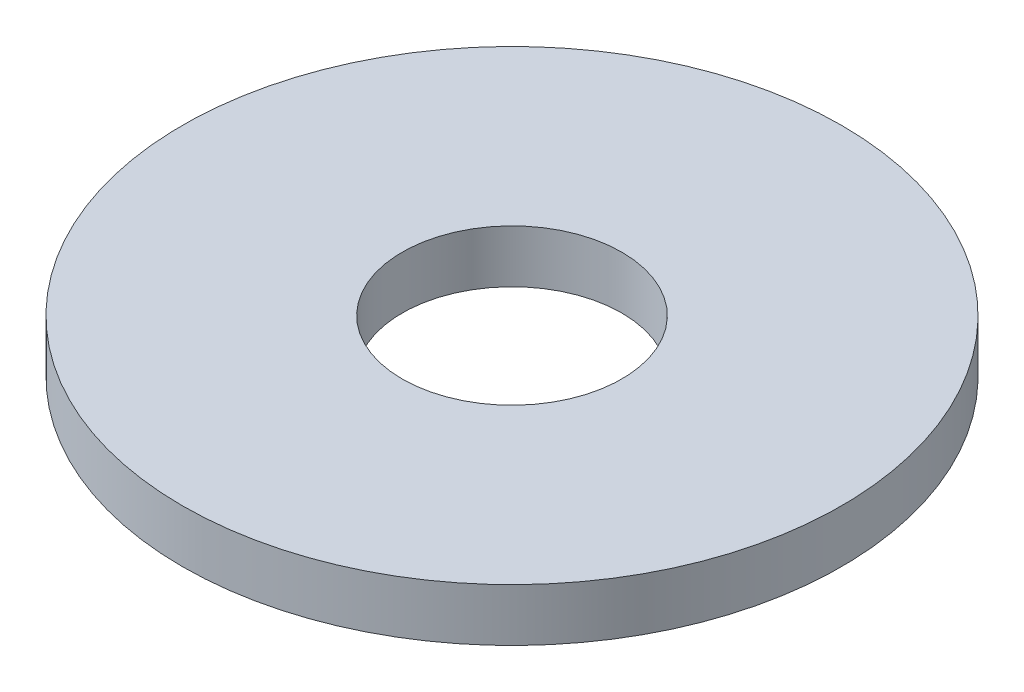
ISO-10303-21;
HEADER;
FILE_DESCRIPTION(('STEP AP214'),'2;1');
FILE_NAME('part.step','',(''),(''),'','','');
FILE_SCHEMA(('AUTOMOTIVE_DESIGN { 1 0 10303 214 1 1 1 1 }'));
ENDSEC;
DATA;
#1=APPLICATION_CONTEXT('core data for automotive mechanical design processes');
#2=APPLICATION_PROTOCOL_DEFINITION('international standard','automotive_design',2000,#1);
#3=PRODUCT_CONTEXT('',#1,'mechanical');
#4=PRODUCT('Part','Part','',(#3));
#5=PRODUCT_RELATED_PRODUCT_CATEGORY('part','',(#4));
#6=PRODUCT_DEFINITION_FORMATION('','',#4);
#7=PRODUCT_DEFINITION_CONTEXT('part definition',#1,'design');
#8=PRODUCT_DEFINITION('design','',#6,#7);
#9=PRODUCT_DEFINITION_SHAPE('','',#8);
#10=(LENGTH_UNIT() NAMED_UNIT(*) SI_UNIT(.MILLI.,.METRE.));
#11=(NAMED_UNIT(*) PLANE_ANGLE_UNIT() SI_UNIT($,.RADIAN.));
#12=(NAMED_UNIT(*) SI_UNIT($,.STERADIAN.) SOLID_ANGLE_UNIT());
#13=UNCERTAINTY_MEASURE_WITH_UNIT(LENGTH_MEASURE(1.E-05),#10,'distance_accuracy_value','');
#14=(GEOMETRIC_REPRESENTATION_CONTEXT(3) GLOBAL_UNCERTAINTY_ASSIGNED_CONTEXT((#13)) GLOBAL_UNIT_ASSIGNED_CONTEXT((#10,
#11,#12)) REPRESENTATION_CONTEXT('',''));
#15=CARTESIAN_POINT('',(0.,0.,0.));
#16=DIRECTION('',(0.,0.,1.));
#17=DIRECTION('',(1.,0.,0.));
#18=AXIS2_PLACEMENT_3D('',#15,#16,#17);
#19=CARTESIAN_POINT('',(0.,12.,0.));
#20=DIRECTION('',(0.,-1.,0.));
#21=DIRECTION('',(0.,0.,-1.));
#22=AXIS2_PLACEMENT_3D('',#19,#20,#21);
#23=CYLINDRICAL_SURFACE('',#22,75.);
#24=CARTESIAN_POINT('',(0.,12.,0.));
#25=DIRECTION('',(0.,1.,0.));
#26=DIRECTION('',(0.,0.,1.));
#27=AXIS2_PLACEMENT_3D('',#24,#25,#26);
#28=CIRCLE('',#27,75.);
#29=CARTESIAN_POINT('',(0.,12.,75.));
#30=VERTEX_POINT('',#29);
#31=EDGE_CURVE('E10',#30,#30,#28,.T.);
#32=ORIENTED_EDGE('',*,*,#31,.F.);
#33=EDGE_LOOP('',(#32));
#34=FACE_BOUND('',#33,.T.);
#35=CARTESIAN_POINT('',(0.,0.,0.));
#36=DIRECTION('',(0.,1.,0.));
#37=DIRECTION('',(0.,0.,1.));
#38=AXIS2_PLACEMENT_3D('',#35,#36,#37);
#39=CIRCLE('',#38,75.);
#40=CARTESIAN_POINT('',(0.,0.,75.));
#41=VERTEX_POINT('',#40);
#42=EDGE_CURVE('E37',#41,#41,#39,.T.);
#43=ORIENTED_EDGE('',*,*,#42,.T.);
#44=EDGE_LOOP('',(#43));
#45=FACE_BOUND('',#44,.T.);
#46=ADVANCED_FACE('F40',(#34,#45),#23,.T.);
#47=CARTESIAN_POINT('',(0.,12.,0.));
#48=DIRECTION('',(0.,1.,0.));
#49=DIRECTION('',(0.,0.,1.));
#50=AXIS2_PLACEMENT_3D('',#47,#48,#49);
#51=PLANE('',#50);
#52=CARTESIAN_POINT('',(0.,12.,0.));
#53=DIRECTION('',(0.,1.,0.));
#54=DIRECTION('',(0.,0.,1.));
#55=AXIS2_PLACEMENT_3D('',#52,#53,#54);
#56=CIRCLE('',#55,25.);
#57=CARTESIAN_POINT('',(0.,12.,25.));
#58=VERTEX_POINT('',#57);
#59=EDGE_CURVE('E50',#58,#58,#56,.T.);
#60=ORIENTED_EDGE('',*,*,#59,.F.);
#61=EDGE_LOOP('',(#60));
#62=FACE_BOUND('',#61,.T.);
#63=ORIENTED_EDGE('',*,*,#31,.T.);
#64=EDGE_LOOP('',(#63));
#65=FACE_BOUND('',#64,.T.);
#66=ADVANCED_FACE('F59',(#62,#65),#51,.T.);
#67=CARTESIAN_POINT('',(0.,0.,0.));
#68=DIRECTION('',(0.,1.,0.));
#69=DIRECTION('',(0.,0.,1.));
#70=AXIS2_PLACEMENT_3D('',#67,#68,#69);
#71=PLANE('',#70);
#72=CARTESIAN_POINT('',(0.,0.,0.));
#73=DIRECTION('',(0.,1.,0.));
#74=DIRECTION('',(0.,0.,1.));
#75=AXIS2_PLACEMENT_3D('',#72,#73,#74);
#76=CIRCLE('',#75,25.);
#77=CARTESIAN_POINT('',(0.,0.,25.));
#78=VERTEX_POINT('',#77);
#79=EDGE_CURVE('E47',#78,#78,#76,.T.);
#80=ORIENTED_EDGE('',*,*,#79,.T.);
#81=EDGE_LOOP('',(#80));
#82=FACE_BOUND('',#81,.T.);
#83=ORIENTED_EDGE('',*,*,#42,.F.);
#84=EDGE_LOOP('',(#83));
#85=FACE_BOUND('',#84,.T.);
#86=ADVANCED_FACE('F58',(#82,#85),#71,.F.);
#87=CARTESIAN_POINT('',(0.,12.,0.));
#88=DIRECTION('',(0.,-1.,0.));
#89=DIRECTION('',(0.,0.,-1.));
#90=AXIS2_PLACEMENT_3D('',#87,#88,#89);
#91=CYLINDRICAL_SURFACE('',#90,25.);
#92=ORIENTED_EDGE('',*,*,#59,.T.);
#93=EDGE_LOOP('',(#92));
#94=FACE_BOUND('',#93,.T.);
#95=ORIENTED_EDGE('',*,*,#79,.F.);
#96=EDGE_LOOP('',(#95));
#97=FACE_BOUND('',#96,.T.);
#98=ADVANCED_FACE('F54',(#94,#97),#91,.F.);
#99=CLOSED_SHELL('',(#46,#66,#86,#98));
#100=MANIFOLD_SOLID_BREP('B2',#99);
#101=ADVANCED_BREP_SHAPE_REPRESENTATION('',(#18,#100),#14);
#102=SHAPE_DEFINITION_REPRESENTATION(#9,#101);
ENDSEC;
END-ISO-10303-21;
